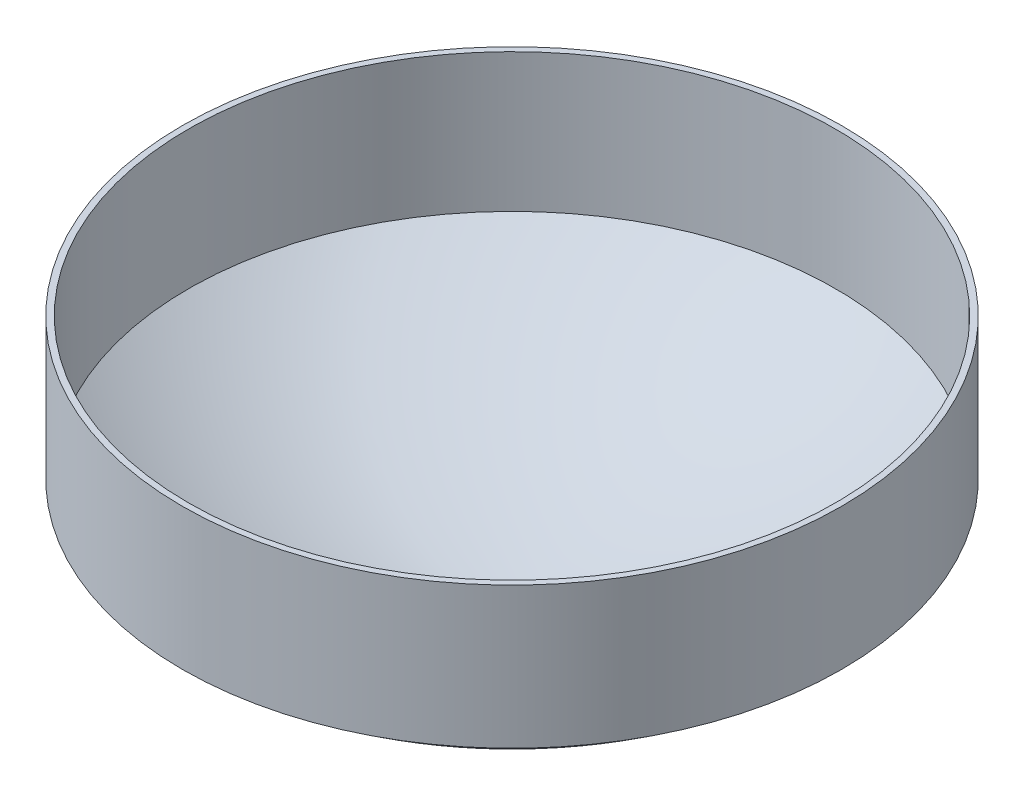
ISO-10303-21;
HEADER;
FILE_DESCRIPTION(('STEP AP214'),'2;1');
FILE_NAME('part.step','',(''),(''),'','','');
FILE_SCHEMA(('AUTOMOTIVE_DESIGN { 1 0 10303 214 1 1 1 1 }'));
ENDSEC;
DATA;
#1=APPLICATION_CONTEXT('core data for automotive mechanical design processes');
#2=APPLICATION_PROTOCOL_DEFINITION('international standard','automotive_design',2000,#1);
#3=PRODUCT_CONTEXT('',#1,'mechanical');
#4=PRODUCT('Part','Part','',(#3));
#5=PRODUCT_RELATED_PRODUCT_CATEGORY('part','',(#4));
#6=PRODUCT_DEFINITION_FORMATION('','',#4);
#7=PRODUCT_DEFINITION_CONTEXT('part definition',#1,'design');
#8=PRODUCT_DEFINITION('design','',#6,#7);
#9=PRODUCT_DEFINITION_SHAPE('','',#8);
#10=(LENGTH_UNIT() NAMED_UNIT(*) SI_UNIT(.MILLI.,.METRE.));
#11=(NAMED_UNIT(*) PLANE_ANGLE_UNIT() SI_UNIT($,.RADIAN.));
#12=(NAMED_UNIT(*) SI_UNIT($,.STERADIAN.) SOLID_ANGLE_UNIT());
#13=UNCERTAINTY_MEASURE_WITH_UNIT(LENGTH_MEASURE(1.E-05),#10,'distance_accuracy_value','');
#14=(GEOMETRIC_REPRESENTATION_CONTEXT(3) GLOBAL_UNCERTAINTY_ASSIGNED_CONTEXT((#13)) GLOBAL_UNIT_ASSIGNED_CONTEXT((#10,
#11,#12)) REPRESENTATION_CONTEXT('',''));
#15=CARTESIAN_POINT('',(0.,0.,0.));
#16=DIRECTION('',(0.,0.,1.));
#17=DIRECTION('',(1.,0.,0.));
#18=AXIS2_PLACEMENT_3D('',#15,#16,#17);
#19=CARTESIAN_POINT('',(0.,76.2,0.));
#20=DIRECTION('',(0.,-1.,0.));
#21=DIRECTION('',(0.,0.,-1.));
#22=AXIS2_PLACEMENT_3D('',#19,#20,#21);
#23=CYLINDRICAL_SURFACE('',#22,174.5488);
#24=CARTESIAN_POINT('',(0.,76.2,0.));
#25=DIRECTION('',(0.,1.,0.));
#26=DIRECTION('',(0.,0.,1.));
#27=AXIS2_PLACEMENT_3D('',#24,#25,#26);
#28=CIRCLE('',#27,174.5488);
#29=CARTESIAN_POINT('',(0.,76.2,174.5488));
#30=VERTEX_POINT('',#29);
#31=EDGE_CURVE('E38',#30,#30,#28,.T.);
#32=ORIENTED_EDGE('',*,*,#31,.T.);
#33=EDGE_LOOP('',(#32));
#34=FACE_BOUND('',#33,.T.);
#35=CARTESIAN_POINT('',(0.,1.5950222675486,0.));
#36=DIRECTION('',(0.,1.,0.));
#37=DIRECTION('',(0.,0.,1.));
#38=AXIS2_PLACEMENT_3D('',#35,#36,#37);
#39=CIRCLE('',#38,174.5488);
#40=CARTESIAN_POINT('',(0.,1.5950222675486,174.5488));
#41=VERTEX_POINT('',#40);
#42=EDGE_CURVE('E34',#41,#41,#39,.F.);
#43=ORIENTED_EDGE('',*,*,#42,.T.);
#44=EDGE_LOOP('',(#43));
#45=FACE_BOUND('',#44,.T.);
#46=ADVANCED_FACE('F30',(#34,#45),#23,.F.);
#47=CARTESIAN_POINT('',(0.,76.2,0.));
#48=DIRECTION('',(0.,1.,0.));
#49=DIRECTION('',(0.,0.,1.));
#50=AXIS2_PLACEMENT_3D('',#47,#48,#49);
#51=PLANE('',#50);
#52=CARTESIAN_POINT('',(0.,76.2,0.));
#53=DIRECTION('',(0.,1.,0.));
#54=DIRECTION('',(0.,0.,1.));
#55=AXIS2_PLACEMENT_3D('',#52,#53,#54);
#56=CIRCLE('',#55,177.8);
#57=CARTESIAN_POINT('',(0.,76.2,177.8));
#58=VERTEX_POINT('',#57);
#59=EDGE_CURVE('E10',#58,#58,#56,.T.);
#60=ORIENTED_EDGE('',*,*,#59,.T.);
#61=EDGE_LOOP('',(#60));
#62=FACE_BOUND('',#61,.T.);
#63=ORIENTED_EDGE('',*,*,#31,.F.);
#64=EDGE_LOOP('',(#63));
#65=FACE_BOUND('',#64,.T.);
#66=ADVANCED_FACE('F73',(#62,#65),#51,.T.);
#67=CARTESIAN_POINT('',(0.,76.2,0.));
#68=DIRECTION('',(0.,-1.,0.));
#69=DIRECTION('',(0.,0.,-1.));
#70=AXIS2_PLACEMENT_3D('',#67,#68,#69);
#71=CYLINDRICAL_SURFACE('',#70,177.8);
#72=ORIENTED_EDGE('',*,*,#59,.F.);
#73=EDGE_LOOP('',(#72));
#74=FACE_BOUND('',#73,.T.);
#75=CARTESIAN_POINT('',(0.,0.,0.));
#76=DIRECTION('',(0.,1.,0.));
#77=DIRECTION('',(0.,0.,1.));
#78=AXIS2_PLACEMENT_3D('',#75,#76,#77);
#79=CIRCLE('',#78,177.8);
#80=CARTESIAN_POINT('',(0.,0.,177.8));
#81=VERTEX_POINT('',#80);
#82=EDGE_CURVE('E44',#81,#81,#79,.T.);
#83=ORIENTED_EDGE('',*,*,#82,.T.);
#84=EDGE_LOOP('',(#83));
#85=FACE_BOUND('',#84,.T.);
#86=ADVANCED_FACE('F32',(#74,#85),#71,.T.);
#87=CARTESIAN_POINT('',(0.,261.771907270691,0.));
#88=DIRECTION('',(0.,1.,0.));
#89=DIRECTION('',(0.,0.,1.));
#90=AXIS2_PLACEMENT_3D('',#87,#88,#89);
#91=DEGENERATE_TOROIDAL_SURFACE('',#90,25.7891891670958,331.621907270691,.F.);
#92=ORIENTED_EDGE('',*,*,#82,.F.);
#93=EDGE_LOOP('',(#92));
#94=FACE_BOUND('',#93,.T.);
#95=CARTESIAN_POINT('',(0.,-67.31,0.));
#96=DIRECTION('',(0.,1.,0.));
#97=DIRECTION('',(0.,0.,1.));
#98=AXIS2_PLACEMENT_3D('',#95,#96,#97);
#99=CIRCLE('',#98,15.1765);
#100=CARTESIAN_POINT('',(0.,-67.31,15.1765));
#101=VERTEX_POINT('',#100);
#102=EDGE_CURVE('E50',#101,#101,#99,.T.);
#103=ORIENTED_EDGE('',*,*,#102,.T.);
#104=EDGE_LOOP('',(#103));
#105=FACE_BOUND('',#104,.T.);
#106=ADVANCED_FACE('F54',(#94,#105),#91,.F.);
#107=CARTESIAN_POINT('',(0.,261.771907270691,0.));
#108=DIRECTION('',(0.,1.,0.));
#109=DIRECTION('',(0.,0.,1.));
#110=AXIS2_PLACEMENT_3D('',#107,#108,#109);
#111=DEGENERATE_TOROIDAL_SURFACE('',#110,25.7891891670958,328.370707270691,.F.);
#112=ORIENTED_EDGE('',*,*,#42,.F.);
#113=EDGE_LOOP('',(#112));
#114=FACE_BOUND('',#113,.T.);
#115=CARTESIAN_POINT('',(0.,-64.0334544171098,0.));
#116=DIRECTION('',(0.,1.,0.));
#117=DIRECTION('',(0.,0.,1.));
#118=AXIS2_PLACEMENT_3D('',#115,#116,#117);
#119=CIRCLE('',#118,15.1765);
#120=CARTESIAN_POINT('',(0.,-64.0334544171098,15.1765));
#121=VERTEX_POINT('',#120);
#122=EDGE_CURVE('E47',#121,#121,#119,.T.);
#123=ORIENTED_EDGE('',*,*,#122,.F.);
#124=EDGE_LOOP('',(#123));
#125=FACE_BOUND('',#124,.T.);
#126=ADVANCED_FACE('F59',(#114,#125),#111,.T.);
#127=CARTESIAN_POINT('',(0.,76.2,0.));
#128=DIRECTION('',(0.,1.,0.));
#129=DIRECTION('',(0.,0.,1.));
#130=AXIS2_PLACEMENT_3D('',#127,#128,#129);
#131=CYLINDRICAL_SURFACE('',#130,15.1765);
#132=ORIENTED_EDGE('',*,*,#102,.F.);
#133=EDGE_LOOP('',(#132));
#134=FACE_BOUND('',#133,.T.);
#135=ORIENTED_EDGE('',*,*,#122,.T.);
#136=EDGE_LOOP('',(#135));
#137=FACE_BOUND('',#136,.T.);
#138=ADVANCED_FACE('F56',(#134,#137),#131,.F.);
#139=CLOSED_SHELL('',(#46,#66,#86,#106,#126,#138));
#140=MANIFOLD_SOLID_BREP('B2',#139);
#141=ADVANCED_BREP_SHAPE_REPRESENTATION('',(#18,#140),#14);
#142=SHAPE_DEFINITION_REPRESENTATION(#9,#141);
ENDSEC;
END-ISO-10303-21;
